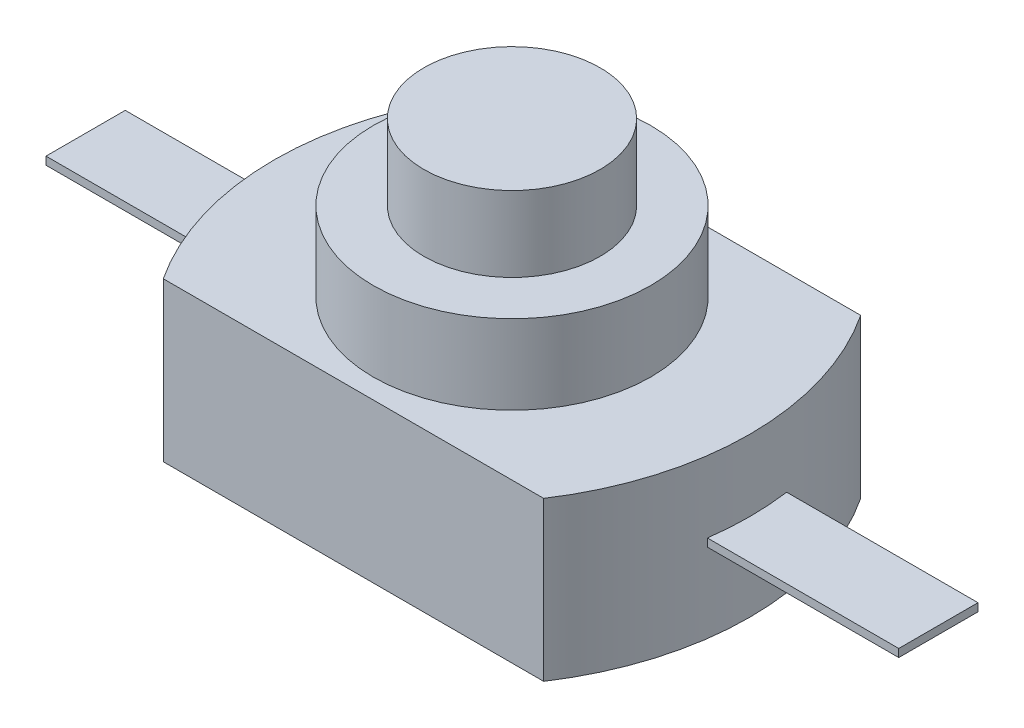
ISO-10303-21;
HEADER;
FILE_DESCRIPTION(('STEP AP214'),'2;1');
FILE_NAME('part.step','',(''),(''),'','','');
FILE_SCHEMA(('AUTOMOTIVE_DESIGN { 1 0 10303 214 1 1 1 1 }'));
ENDSEC;
DATA;
#1=APPLICATION_CONTEXT('core data for automotive mechanical design processes');
#2=APPLICATION_PROTOCOL_DEFINITION('international standard','automotive_design',2000,#1);
#3=PRODUCT_CONTEXT('',#1,'mechanical');
#4=PRODUCT('Part','Part','',(#3));
#5=PRODUCT_RELATED_PRODUCT_CATEGORY('part','',(#4));
#6=PRODUCT_DEFINITION_FORMATION('','',#4);
#7=PRODUCT_DEFINITION_CONTEXT('part definition',#1,'design');
#8=PRODUCT_DEFINITION('design','',#6,#7);
#9=PRODUCT_DEFINITION_SHAPE('','',#8);
#10=(LENGTH_UNIT() NAMED_UNIT(*) SI_UNIT(.MILLI.,.METRE.));
#11=(NAMED_UNIT(*) PLANE_ANGLE_UNIT() SI_UNIT($,.RADIAN.));
#12=(NAMED_UNIT(*) SI_UNIT($,.STERADIAN.) SOLID_ANGLE_UNIT());
#13=UNCERTAINTY_MEASURE_WITH_UNIT(LENGTH_MEASURE(1.E-05),#10,'distance_accuracy_value','');
#14=(GEOMETRIC_REPRESENTATION_CONTEXT(3) GLOBAL_UNCERTAINTY_ASSIGNED_CONTEXT((#13)) GLOBAL_UNIT_ASSIGNED_CONTEXT((#10,
#11,#12)) REPRESENTATION_CONTEXT('',''));
#15=CARTESIAN_POINT('',(0.,0.,0.));
#16=DIRECTION('',(0.,0.,1.));
#17=DIRECTION('',(1.,0.,0.));
#18=AXIS2_PLACEMENT_3D('',#15,#16,#17);
#19=CARTESIAN_POINT('',(6.06666666666668,4.,4.));
#20=DIRECTION('',(0.,-1.,0.));
#21=DIRECTION('',(0.,0.,-1.));
#22=AXIS2_PLACEMENT_3D('',#19,#20,#21);
#23=CYLINDRICAL_SURFACE('',#22,7.26666666666667);
#24=CARTESIAN_POINT('',(6.06666666666668,0.,4.));
#25=DIRECTION('',(0.,1.,0.));
#26=DIRECTION('',(0.,0.,1.));
#27=AXIS2_PLACEMENT_3D('',#24,#25,#26);
#28=CIRCLE('',#27,7.26666666666667);
#29=CARTESIAN_POINT('',(0.,0.,0.));
#30=VERTEX_POINT('',#29);
#31=CARTESIAN_POINT('',(0.,0.,8.));
#32=VERTEX_POINT('',#31);
#33=EDGE_CURVE('E190',#30,#32,#28,.T.);
#34=ORIENTED_EDGE('',*,*,#33,.T.);
#35=DIRECTION('',(0.,-1.,0.));
#36=VECTOR('',#35,1.);
#37=CARTESIAN_POINT('',(0.,4.,8.));
#38=LINE('',#37,#36);
#39=CARTESIAN_POINT('',(0.,4.,8.));
#40=VERTEX_POINT('',#39);
#41=EDGE_CURVE('E198',#40,#32,#38,.T.);
#42=ORIENTED_EDGE('',*,*,#41,.F.);
#43=CARTESIAN_POINT('',(6.06666666666668,4.,4.));
#44=DIRECTION('',(0.,1.,0.));
#45=DIRECTION('',(0.,0.,1.));
#46=AXIS2_PLACEMENT_3D('',#43,#44,#45);
#47=CIRCLE('',#46,7.26666666666667);
#48=CARTESIAN_POINT('',(0.,4.,0.));
#49=VERTEX_POINT('',#48);
#50=EDGE_CURVE('E196',#49,#40,#47,.T.);
#51=ORIENTED_EDGE('',*,*,#50,.F.);
#52=DIRECTION('',(0.,-1.,0.));
#53=VECTOR('',#52,1.);
#54=CARTESIAN_POINT('',(0.,4.,0.));
#55=LINE('',#54,#53);
#56=EDGE_CURVE('E210',#49,#30,#55,.T.);
#57=ORIENTED_EDGE('',*,*,#56,.T.);
#58=EDGE_LOOP('',(#34,#42,#51,#57));
#59=FACE_BOUND('',#58,.T.);
#60=CARTESIAN_POINT('',(6.06666666666668,2.2,4.));
#61=DIRECTION('',(0.,-1.,0.));
#62=DIRECTION('',(0.,0.,-1.));
#63=AXIS2_PLACEMENT_3D('',#60,#61,#62);
#64=CIRCLE('',#63,7.26666666666667);
#65=CARTESIAN_POINT('',(-1.13086377400841,2.2,5.));
#66=VERTEX_POINT('',#65);
#67=CARTESIAN_POINT('',(-1.13086377400841,2.2,3.));
#68=VERTEX_POINT('',#67);
#69=EDGE_CURVE('E221',#66,#68,#64,.T.);
#70=ORIENTED_EDGE('',*,*,#69,.F.);
#71=DIRECTION('',(0.,-1.,0.));
#72=VECTOR('',#71,1.);
#73=CARTESIAN_POINT('',(-1.13086377400841,4.,5.));
#74=LINE('',#73,#72);
#75=CARTESIAN_POINT('',(-1.13086377400841,2.,5.));
#76=VERTEX_POINT('',#75);
#77=EDGE_CURVE('E217',#76,#66,#74,.F.);
#78=ORIENTED_EDGE('',*,*,#77,.F.);
#79=CARTESIAN_POINT('',(6.06666666666668,2.,4.));
#80=DIRECTION('',(0.,-1.,0.));
#81=DIRECTION('',(0.,0.,-1.));
#82=AXIS2_PLACEMENT_3D('',#79,#80,#81);
#83=CIRCLE('',#82,7.26666666666667);
#84=CARTESIAN_POINT('',(-1.13086377400841,2.,3.));
#85=VERTEX_POINT('',#84);
#86=EDGE_CURVE('E179',#76,#85,#83,.T.);
#87=ORIENTED_EDGE('',*,*,#86,.T.);
#88=DIRECTION('',(0.,-1.,0.));
#89=VECTOR('',#88,1.);
#90=CARTESIAN_POINT('',(-1.13086377400841,4.,3.));
#91=LINE('',#90,#89);
#92=EDGE_CURVE('E219',#68,#85,#91,.T.);
#93=ORIENTED_EDGE('',*,*,#92,.F.);
#94=EDGE_LOOP('',(#70,#78,#87,#93));
#95=FACE_BOUND('',#94,.T.);
#96=ADVANCED_FACE('F35',(#59,#95),#23,.T.);
#97=CARTESIAN_POINT('',(0.,4.,8.));
#98=DIRECTION('',(0.,0.,-1.));
#99=DIRECTION('',(-1.,0.,0.));
#100=AXIS2_PLACEMENT_3D('',#97,#98,#99);
#101=PLANE('',#100);
#102=DIRECTION('',(1.,0.,0.));
#103=VECTOR('',#102,1.);
#104=CARTESIAN_POINT('',(0.,0.,8.));
#105=LINE('',#104,#103);
#106=CARTESIAN_POINT('',(9.6,0.,8.));
#107=VERTEX_POINT('',#106);
#108=EDGE_CURVE('E183',#32,#107,#105,.T.);
#109=ORIENTED_EDGE('',*,*,#108,.T.);
#110=DIRECTION('',(0.,-1.,0.));
#111=VECTOR('',#110,1.);
#112=CARTESIAN_POINT('',(9.6,4.,8.));
#113=LINE('',#112,#111);
#114=CARTESIAN_POINT('',(9.6,4.,8.));
#115=VERTEX_POINT('',#114);
#116=EDGE_CURVE('E186',#115,#107,#113,.T.);
#117=ORIENTED_EDGE('',*,*,#116,.F.);
#118=DIRECTION('',(1.,0.,0.));
#119=VECTOR('',#118,1.);
#120=CARTESIAN_POINT('',(0.,4.,8.));
#121=LINE('',#120,#119);
#122=EDGE_CURVE('E187',#40,#115,#121,.T.);
#123=ORIENTED_EDGE('',*,*,#122,.F.);
#124=ORIENTED_EDGE('',*,*,#41,.T.);
#125=EDGE_LOOP('',(#109,#117,#123,#124));
#126=FACE_BOUND('',#125,.T.);
#127=ADVANCED_FACE('F37',(#126),#101,.F.);
#128=CARTESIAN_POINT('',(3.53333333333332,4.,4.));
#129=DIRECTION('',(0.,-1.,0.));
#130=DIRECTION('',(0.,0.,-1.));
#131=AXIS2_PLACEMENT_3D('',#128,#129,#130);
#132=CYLINDRICAL_SURFACE('',#131,7.26666666666667);
#133=CARTESIAN_POINT('',(3.53333333333332,2.2,4.));
#134=DIRECTION('',(0.,1.,0.));
#135=DIRECTION('',(0.,0.,1.));
#136=AXIS2_PLACEMENT_3D('',#133,#134,#135);
#137=CIRCLE('',#136,7.26666666666667);
#138=CARTESIAN_POINT('',(10.7308637740084,2.2,3.));
#139=VERTEX_POINT('',#138);
#140=CARTESIAN_POINT('',(10.7308637740084,2.2,5.));
#141=VERTEX_POINT('',#140);
#142=EDGE_CURVE('E11',#139,#141,#137,.F.);
#143=ORIENTED_EDGE('',*,*,#142,.F.);
#144=DIRECTION('',(0.,-1.,0.));
#145=VECTOR('',#144,1.);
#146=CARTESIAN_POINT('',(10.7308637740084,4.,3.));
#147=LINE('',#146,#145);
#148=CARTESIAN_POINT('',(10.7308637740084,2.,3.));
#149=VERTEX_POINT('',#148);
#150=EDGE_CURVE('E226',#139,#149,#147,.T.);
#151=ORIENTED_EDGE('',*,*,#150,.T.);
#152=CARTESIAN_POINT('',(3.53333333333332,2.,4.));
#153=DIRECTION('',(0.,1.,0.));
#154=DIRECTION('',(0.,0.,1.));
#155=AXIS2_PLACEMENT_3D('',#152,#153,#154);
#156=CIRCLE('',#155,7.26666666666667);
#157=CARTESIAN_POINT('',(10.7308637740084,2.,5.));
#158=VERTEX_POINT('',#157);
#159=EDGE_CURVE('E223',#149,#158,#156,.F.);
#160=ORIENTED_EDGE('',*,*,#159,.T.);
#161=DIRECTION('',(0.,-1.,0.));
#162=VECTOR('',#161,1.);
#163=CARTESIAN_POINT('',(10.7308637740084,4.,5.));
#164=LINE('',#163,#162);
#165=EDGE_CURVE('E43',#158,#141,#164,.F.);
#166=ORIENTED_EDGE('',*,*,#165,.T.);
#167=EDGE_LOOP('',(#143,#151,#160,#166));
#168=FACE_BOUND('',#167,.T.);
#169=CARTESIAN_POINT('',(3.53333333333332,0.,4.));
#170=DIRECTION('',(0.,1.,0.));
#171=DIRECTION('',(0.,0.,1.));
#172=AXIS2_PLACEMENT_3D('',#169,#170,#171);
#173=CIRCLE('',#172,7.26666666666667);
#174=CARTESIAN_POINT('',(9.6,0.,0.));
#175=VERTEX_POINT('',#174);
#176=EDGE_CURVE('E201',#175,#107,#173,.F.);
#177=ORIENTED_EDGE('',*,*,#176,.F.);
#178=DIRECTION('',(0.,-1.,0.));
#179=VECTOR('',#178,1.);
#180=CARTESIAN_POINT('',(9.6,4.,0.));
#181=LINE('',#180,#179);
#182=CARTESIAN_POINT('',(9.6,4.,0.));
#183=VERTEX_POINT('',#182);
#184=EDGE_CURVE('E212',#183,#175,#181,.T.);
#185=ORIENTED_EDGE('',*,*,#184,.F.);
#186=CARTESIAN_POINT('',(3.53333333333332,4.,4.));
#187=DIRECTION('',(0.,1.,0.));
#188=DIRECTION('',(0.,0.,1.));
#189=AXIS2_PLACEMENT_3D('',#186,#187,#188);
#190=CIRCLE('',#189,7.26666666666667);
#191=EDGE_CURVE('E189',#183,#115,#190,.F.);
#192=ORIENTED_EDGE('',*,*,#191,.T.);
#193=ORIENTED_EDGE('',*,*,#116,.T.);
#194=EDGE_LOOP('',(#177,#185,#192,#193));
#195=FACE_BOUND('',#194,.T.);
#196=ADVANCED_FACE('F229',(#168,#195),#132,.T.);
#197=CARTESIAN_POINT('',(0.,4.,0.));
#198=DIRECTION('',(0.,0.,-1.));
#199=DIRECTION('',(-1.,0.,0.));
#200=AXIS2_PLACEMENT_3D('',#197,#198,#199);
#201=PLANE('',#200);
#202=DIRECTION('',(1.,0.,0.));
#203=VECTOR('',#202,1.);
#204=CARTESIAN_POINT('',(0.,0.,0.));
#205=LINE('',#204,#203);
#206=EDGE_CURVE('E204',#30,#175,#205,.T.);
#207=ORIENTED_EDGE('',*,*,#206,.F.);
#208=ORIENTED_EDGE('',*,*,#56,.F.);
#209=DIRECTION('',(1.,0.,0.));
#210=VECTOR('',#209,1.);
#211=CARTESIAN_POINT('',(0.,4.,0.));
#212=LINE('',#211,#210);
#213=EDGE_CURVE('E193',#49,#183,#212,.T.);
#214=ORIENTED_EDGE('',*,*,#213,.T.);
#215=ORIENTED_EDGE('',*,*,#184,.T.);
#216=EDGE_LOOP('',(#207,#208,#214,#215));
#217=FACE_BOUND('',#216,.T.);
#218=ADVANCED_FACE('F258',(#217),#201,.T.);
#219=CARTESIAN_POINT('',(0.,4.,0.));
#220=DIRECTION('',(0.,1.,0.));
#221=DIRECTION('',(0.,0.,1.));
#222=AXIS2_PLACEMENT_3D('',#219,#220,#221);
#223=PLANE('',#222);
#224=CARTESIAN_POINT('',(4.8,4.,4.));
#225=DIRECTION('',(0.,1.,0.));
#226=DIRECTION('',(0.,0.,1.));
#227=AXIS2_PLACEMENT_3D('',#224,#225,#226);
#228=CIRCLE('',#227,3.5);
#229=CARTESIAN_POINT('',(4.8,4.,7.5));
#230=VERTEX_POINT('',#229);
#231=EDGE_CURVE('E180',#230,#230,#228,.T.);
#232=ORIENTED_EDGE('',*,*,#231,.F.);
#233=EDGE_LOOP('',(#232));
#234=FACE_BOUND('',#233,.T.);
#235=ORIENTED_EDGE('',*,*,#122,.T.);
#236=ORIENTED_EDGE('',*,*,#191,.F.);
#237=ORIENTED_EDGE('',*,*,#213,.F.);
#238=ORIENTED_EDGE('',*,*,#50,.T.);
#239=EDGE_LOOP('',(#235,#236,#237,#238));
#240=FACE_BOUND('',#239,.T.);
#241=ADVANCED_FACE('F260',(#234,#240),#223,.T.);
#242=CARTESIAN_POINT('',(0.,0.,0.));
#243=DIRECTION('',(0.,1.,0.));
#244=DIRECTION('',(0.,0.,1.));
#245=AXIS2_PLACEMENT_3D('',#242,#243,#244);
#246=PLANE('',#245);
#247=ORIENTED_EDGE('',*,*,#108,.F.);
#248=ORIENTED_EDGE('',*,*,#33,.F.);
#249=ORIENTED_EDGE('',*,*,#206,.T.);
#250=ORIENTED_EDGE('',*,*,#176,.T.);
#251=EDGE_LOOP('',(#247,#248,#249,#250));
#252=FACE_BOUND('',#251,.T.);
#253=ADVANCED_FACE('F256',(#252),#246,.F.);
#254=CARTESIAN_POINT('',(4.8,6.,4.));
#255=DIRECTION('',(0.,-1.,0.));
#256=DIRECTION('',(0.,0.,-1.));
#257=AXIS2_PLACEMENT_3D('',#254,#255,#256);
#258=CYLINDRICAL_SURFACE('',#257,3.5);
#259=CARTESIAN_POINT('',(4.8,6.,4.));
#260=DIRECTION('',(0.,1.,0.));
#261=DIRECTION('',(0.,0.,1.));
#262=AXIS2_PLACEMENT_3D('',#259,#260,#261);
#263=CIRCLE('',#262,3.5);
#264=CARTESIAN_POINT('',(4.8,6.,7.5));
#265=VERTEX_POINT('',#264);
#266=EDGE_CURVE('E175',#265,#265,#263,.T.);
#267=ORIENTED_EDGE('',*,*,#266,.F.);
#268=EDGE_LOOP('',(#267));
#269=FACE_BOUND('',#268,.T.);
#270=ORIENTED_EDGE('',*,*,#231,.T.);
#271=EDGE_LOOP('',(#270));
#272=FACE_BOUND('',#271,.T.);
#273=ADVANCED_FACE('F359',(#269,#272),#258,.T.);
#274=CARTESIAN_POINT('',(4.8,6.,4.));
#275=DIRECTION('',(0.,1.,0.));
#276=DIRECTION('',(0.,0.,1.));
#277=AXIS2_PLACEMENT_3D('',#274,#275,#276);
#278=PLANE('',#277);
#279=CARTESIAN_POINT('',(4.8,6.,4.));
#280=DIRECTION('',(0.,1.,0.));
#281=DIRECTION('',(0.,0.,1.));
#282=AXIS2_PLACEMENT_3D('',#279,#280,#281);
#283=CIRCLE('',#282,2.225);
#284=CARTESIAN_POINT('',(4.8,6.,6.225));
#285=VERTEX_POINT('',#284);
#286=EDGE_CURVE('E176',#285,#285,#283,.T.);
#287=ORIENTED_EDGE('',*,*,#286,.F.);
#288=EDGE_LOOP('',(#287));
#289=FACE_BOUND('',#288,.T.);
#290=ORIENTED_EDGE('',*,*,#266,.T.);
#291=EDGE_LOOP('',(#290));
#292=FACE_BOUND('',#291,.T.);
#293=ADVANCED_FACE('F355',(#289,#292),#278,.T.);
#294=CARTESIAN_POINT('',(4.8,7.9,4.));
#295=DIRECTION('',(0.,-1.,0.));
#296=DIRECTION('',(0.,0.,-1.));
#297=AXIS2_PLACEMENT_3D('',#294,#295,#296);
#298=CYLINDRICAL_SURFACE('',#297,2.225);
#299=CARTESIAN_POINT('',(4.8,7.9,4.));
#300=DIRECTION('',(0.,1.,0.));
#301=DIRECTION('',(0.,0.,1.));
#302=AXIS2_PLACEMENT_3D('',#299,#300,#301);
#303=CIRCLE('',#302,2.225);
#304=CARTESIAN_POINT('',(4.8,7.9,6.225));
#305=VERTEX_POINT('',#304);
#306=EDGE_CURVE('E172',#305,#305,#303,.T.);
#307=ORIENTED_EDGE('',*,*,#306,.F.);
#308=EDGE_LOOP('',(#307));
#309=FACE_BOUND('',#308,.T.);
#310=ORIENTED_EDGE('',*,*,#286,.T.);
#311=EDGE_LOOP('',(#310));
#312=FACE_BOUND('',#311,.T.);
#313=ADVANCED_FACE('F351',(#309,#312),#298,.T.);
#314=CARTESIAN_POINT('',(4.8,7.9,4.));
#315=DIRECTION('',(0.,1.,0.));
#316=DIRECTION('',(0.,0.,1.));
#317=AXIS2_PLACEMENT_3D('',#314,#315,#316);
#318=PLANE('',#317);
#319=ORIENTED_EDGE('',*,*,#306,.T.);
#320=EDGE_LOOP('',(#319));
#321=FACE_BOUND('',#320,.T.);
#322=ADVANCED_FACE('F273',(#321),#318,.T.);
#323=CARTESIAN_POINT('',(-0.867987634755075,2.2,3.));
#324=DIRECTION('',(0.,0.,1.));
#325=DIRECTION('',(1.,0.,0.));
#326=AXIS2_PLACEMENT_3D('',#323,#324,#325);
#327=PLANE('',#326);
#328=DIRECTION('',(-1.,0.,0.));
#329=VECTOR('',#328,1.);
#330=CARTESIAN_POINT('',(-0.867987634755075,2.2,3.));
#331=LINE('',#330,#329);
#332=CARTESIAN_POINT('',(-5.9600134775258,2.2,3.));
#333=VERTEX_POINT('',#332);
#334=EDGE_CURVE('E153',#68,#333,#331,.T.);
#335=ORIENTED_EDGE('',*,*,#334,.F.);
#336=ORIENTED_EDGE('',*,*,#92,.T.);
#337=DIRECTION('',(-1.,0.,0.));
#338=VECTOR('',#337,1.);
#339=CARTESIAN_POINT('',(-0.867987634755075,2.,3.));
#340=LINE('',#339,#338);
#341=CARTESIAN_POINT('',(-5.9600134775258,2.,3.));
#342=VERTEX_POINT('',#341);
#343=EDGE_CURVE('E58',#85,#342,#340,.T.);
#344=ORIENTED_EDGE('',*,*,#343,.T.);
#345=DIRECTION('',(0.,-1.,0.));
#346=VECTOR('',#345,1.);
#347=CARTESIAN_POINT('',(-5.9600134775258,2.2,3.));
#348=LINE('',#347,#346);
#349=EDGE_CURVE('E169',#333,#342,#348,.T.);
#350=ORIENTED_EDGE('',*,*,#349,.F.);
#351=EDGE_LOOP('',(#335,#336,#344,#350));
#352=FACE_BOUND('',#351,.T.);
#353=ADVANCED_FACE('F267',(#352),#327,.F.);
#354=CARTESIAN_POINT('',(-0.867987634755075,2.2,5.));
#355=DIRECTION('',(0.,0.,-1.));
#356=DIRECTION('',(-1.,0.,0.));
#357=AXIS2_PLACEMENT_3D('',#354,#355,#356);
#358=PLANE('',#357);
#359=DIRECTION('',(1.,0.,0.));
#360=VECTOR('',#359,1.);
#361=CARTESIAN_POINT('',(-0.867987634755075,2.,5.));
#362=LINE('',#361,#360);
#363=CARTESIAN_POINT('',(-5.9600134775258,2.,5.));
#364=VERTEX_POINT('',#363);
#365=EDGE_CURVE('E156',#364,#76,#362,.T.);
#366=ORIENTED_EDGE('',*,*,#365,.T.);
#367=ORIENTED_EDGE('',*,*,#77,.T.);
#368=DIRECTION('',(1.,0.,0.));
#369=VECTOR('',#368,1.);
#370=CARTESIAN_POINT('',(-0.867987634755075,2.2,5.));
#371=LINE('',#370,#369);
#372=CARTESIAN_POINT('',(-5.9600134775258,2.2,5.));
#373=VERTEX_POINT('',#372);
#374=EDGE_CURVE('E158',#373,#66,#371,.T.);
#375=ORIENTED_EDGE('',*,*,#374,.F.);
#376=DIRECTION('',(0.,-1.,0.));
#377=VECTOR('',#376,1.);
#378=CARTESIAN_POINT('',(-5.9600134775258,2.2,5.));
#379=LINE('',#378,#377);
#380=EDGE_CURVE('E161',#373,#364,#379,.T.);
#381=ORIENTED_EDGE('',*,*,#380,.T.);
#382=EDGE_LOOP('',(#366,#367,#375,#381));
#383=FACE_BOUND('',#382,.T.);
#384=ADVANCED_FACE('F272',(#383),#358,.F.);
#385=CARTESIAN_POINT('',(-5.9600134775258,2.2,3.));
#386=DIRECTION('',(1.,0.,0.));
#387=DIRECTION('',(0.,0.,-1.));
#388=AXIS2_PLACEMENT_3D('',#385,#386,#387);
#389=PLANE('',#388);
#390=DIRECTION('',(0.,0.,1.));
#391=VECTOR('',#390,1.);
#392=CARTESIAN_POINT('',(-5.9600134775258,2.,3.));
#393=LINE('',#392,#391);
#394=EDGE_CURVE('E163',#342,#364,#393,.T.);
#395=ORIENTED_EDGE('',*,*,#394,.T.);
#396=ORIENTED_EDGE('',*,*,#380,.F.);
#397=DIRECTION('',(0.,0.,1.));
#398=VECTOR('',#397,1.);
#399=CARTESIAN_POINT('',(-5.9600134775258,2.2,3.));
#400=LINE('',#399,#398);
#401=EDGE_CURVE('E155',#333,#373,#400,.T.);
#402=ORIENTED_EDGE('',*,*,#401,.F.);
#403=ORIENTED_EDGE('',*,*,#349,.T.);
#404=EDGE_LOOP('',(#395,#396,#402,#403));
#405=FACE_BOUND('',#404,.T.);
#406=ADVANCED_FACE('F284',(#405),#389,.F.);
#407=CARTESIAN_POINT('',(0.,2.2,0.));
#408=DIRECTION('',(0.,-1.,0.));
#409=DIRECTION('',(0.,0.,-1.));
#410=AXIS2_PLACEMENT_3D('',#407,#408,#409);
#411=PLANE('',#410);
#412=ORIENTED_EDGE('',*,*,#374,.T.);
#413=ORIENTED_EDGE('',*,*,#69,.T.);
#414=ORIENTED_EDGE('',*,*,#334,.T.);
#415=ORIENTED_EDGE('',*,*,#401,.T.);
#416=EDGE_LOOP('',(#412,#413,#414,#415));
#417=FACE_BOUND('',#416,.T.);
#418=ADVANCED_FACE('F294',(#417),#411,.F.);
#419=CARTESIAN_POINT('',(0.,2.,0.));
#420=DIRECTION('',(0.,-1.,0.));
#421=DIRECTION('',(0.,0.,-1.));
#422=AXIS2_PLACEMENT_3D('',#419,#420,#421);
#423=PLANE('',#422);
#424=ORIENTED_EDGE('',*,*,#86,.F.);
#425=ORIENTED_EDGE('',*,*,#365,.F.);
#426=ORIENTED_EDGE('',*,*,#394,.F.);
#427=ORIENTED_EDGE('',*,*,#343,.F.);
#428=EDGE_LOOP('',(#424,#425,#426,#427));
#429=FACE_BOUND('',#428,.T.);
#430=ADVANCED_FACE('F304',(#429),#423,.T.);
#431=CARTESIAN_POINT('',(10.4679876347551,2.2,5.));
#432=DIRECTION('',(0.,0.,-1.));
#433=DIRECTION('',(-1.,0.,0.));
#434=AXIS2_PLACEMENT_3D('',#431,#432,#433);
#435=PLANE('',#434);
#436=ORIENTED_EDGE('',*,*,#165,.F.);
#437=DIRECTION('',(1.,0.,0.));
#438=VECTOR('',#437,1.);
#439=CARTESIAN_POINT('',(10.4679876347551,2.,5.));
#440=LINE('',#439,#438);
#441=CARTESIAN_POINT('',(15.5600134775258,2.,5.));
#442=VERTEX_POINT('',#441);
#443=EDGE_CURVE('E50',#158,#442,#440,.T.);
#444=ORIENTED_EDGE('',*,*,#443,.T.);
#445=DIRECTION('',(0.,-1.,0.));
#446=VECTOR('',#445,1.);
#447=CARTESIAN_POINT('',(15.5600134775258,2.2,5.));
#448=LINE('',#447,#446);
#449=CARTESIAN_POINT('',(15.5600134775258,2.2,5.));
#450=VERTEX_POINT('',#449);
#451=EDGE_CURVE('E135',#450,#442,#448,.T.);
#452=ORIENTED_EDGE('',*,*,#451,.F.);
#453=DIRECTION('',(1.,0.,0.));
#454=VECTOR('',#453,1.);
#455=CARTESIAN_POINT('',(10.4679876347551,2.2,5.));
#456=LINE('',#455,#454);
#457=EDGE_CURVE('E122',#141,#450,#456,.T.);
#458=ORIENTED_EDGE('',*,*,#457,.F.);
#459=EDGE_LOOP('',(#436,#444,#452,#458));
#460=FACE_BOUND('',#459,.T.);
#461=ADVANCED_FACE('F136',(#460),#435,.F.);
#462=CARTESIAN_POINT('',(15.5600134775258,2.2,3.));
#463=DIRECTION('',(-1.,0.,0.));
#464=DIRECTION('',(0.,0.,1.));
#465=AXIS2_PLACEMENT_3D('',#462,#463,#464);
#466=PLANE('',#465);
#467=DIRECTION('',(0.,0.,-1.));
#468=VECTOR('',#467,1.);
#469=CARTESIAN_POINT('',(15.5600134775258,2.,3.));
#470=LINE('',#469,#468);
#471=CARTESIAN_POINT('',(15.5600134775258,2.,3.));
#472=VERTEX_POINT('',#471);
#473=EDGE_CURVE('E148',#442,#472,#470,.T.);
#474=ORIENTED_EDGE('',*,*,#473,.T.);
#475=DIRECTION('',(0.,-1.,0.));
#476=VECTOR('',#475,1.);
#477=CARTESIAN_POINT('',(15.5600134775258,2.2,3.));
#478=LINE('',#477,#476);
#479=CARTESIAN_POINT('',(15.5600134775258,2.2,3.));
#480=VERTEX_POINT('',#479);
#481=EDGE_CURVE('E138',#480,#472,#478,.T.);
#482=ORIENTED_EDGE('',*,*,#481,.F.);
#483=DIRECTION('',(0.,0.,-1.));
#484=VECTOR('',#483,1.);
#485=CARTESIAN_POINT('',(15.5600134775258,2.2,3.));
#486=LINE('',#485,#484);
#487=EDGE_CURVE('E127',#450,#480,#486,.T.);
#488=ORIENTED_EDGE('',*,*,#487,.F.);
#489=ORIENTED_EDGE('',*,*,#451,.T.);
#490=EDGE_LOOP('',(#474,#482,#488,#489));
#491=FACE_BOUND('',#490,.T.);
#492=ADVANCED_FACE('F140',(#491),#466,.F.);
#493=CARTESIAN_POINT('',(10.4679876347551,2.2,3.));
#494=DIRECTION('',(0.,0.,1.));
#495=DIRECTION('',(1.,0.,0.));
#496=AXIS2_PLACEMENT_3D('',#493,#494,#495);
#497=PLANE('',#496);
#498=ORIENTED_EDGE('',*,*,#150,.F.);
#499=DIRECTION('',(-1.,0.,0.));
#500=VECTOR('',#499,1.);
#501=CARTESIAN_POINT('',(10.4679876347551,2.2,3.));
#502=LINE('',#501,#500);
#503=EDGE_CURVE('E143',#480,#139,#502,.T.);
#504=ORIENTED_EDGE('',*,*,#503,.F.);
#505=ORIENTED_EDGE('',*,*,#481,.T.);
#506=DIRECTION('',(-1.,0.,0.));
#507=VECTOR('',#506,1.);
#508=CARTESIAN_POINT('',(10.4679876347551,2.,3.));
#509=LINE('',#508,#507);
#510=EDGE_CURVE('E132',#472,#149,#509,.T.);
#511=ORIENTED_EDGE('',*,*,#510,.T.);
#512=EDGE_LOOP('',(#498,#504,#505,#511));
#513=FACE_BOUND('',#512,.T.);
#514=ADVANCED_FACE('F234',(#513),#497,.F.);
#515=CARTESIAN_POINT('',(0.,2.2,0.));
#516=DIRECTION('',(0.,1.,0.));
#517=DIRECTION('',(0.,0.,1.));
#518=AXIS2_PLACEMENT_3D('',#515,#516,#517);
#519=PLANE('',#518);
#520=ORIENTED_EDGE('',*,*,#503,.T.);
#521=ORIENTED_EDGE('',*,*,#142,.T.);
#522=ORIENTED_EDGE('',*,*,#457,.T.);
#523=ORIENTED_EDGE('',*,*,#487,.T.);
#524=EDGE_LOOP('',(#520,#521,#522,#523));
#525=FACE_BOUND('',#524,.T.);
#526=ADVANCED_FACE('F125',(#525),#519,.T.);
#527=CARTESIAN_POINT('',(0.,2.,0.));
#528=DIRECTION('',(0.,1.,0.));
#529=DIRECTION('',(0.,0.,1.));
#530=AXIS2_PLACEMENT_3D('',#527,#528,#529);
#531=PLANE('',#530);
#532=ORIENTED_EDGE('',*,*,#159,.F.);
#533=ORIENTED_EDGE('',*,*,#510,.F.);
#534=ORIENTED_EDGE('',*,*,#473,.F.);
#535=ORIENTED_EDGE('',*,*,#443,.F.);
#536=EDGE_LOOP('',(#532,#533,#534,#535));
#537=FACE_BOUND('',#536,.T.);
#538=ADVANCED_FACE('F232',(#537),#531,.F.);
#539=CLOSED_SHELL('',(#96,#127,#196,#218,#241,#253,#273,#293,#313,#322,#353,#384,#406,#418,#430,
#461,#492,#514,#526,#538));
#540=MANIFOLD_SOLID_BREP('B2',#539);
#541=ADVANCED_BREP_SHAPE_REPRESENTATION('',(#18,#540),#14);
#542=SHAPE_DEFINITION_REPRESENTATION(#9,#541);
ENDSEC;
END-ISO-10303-21;
